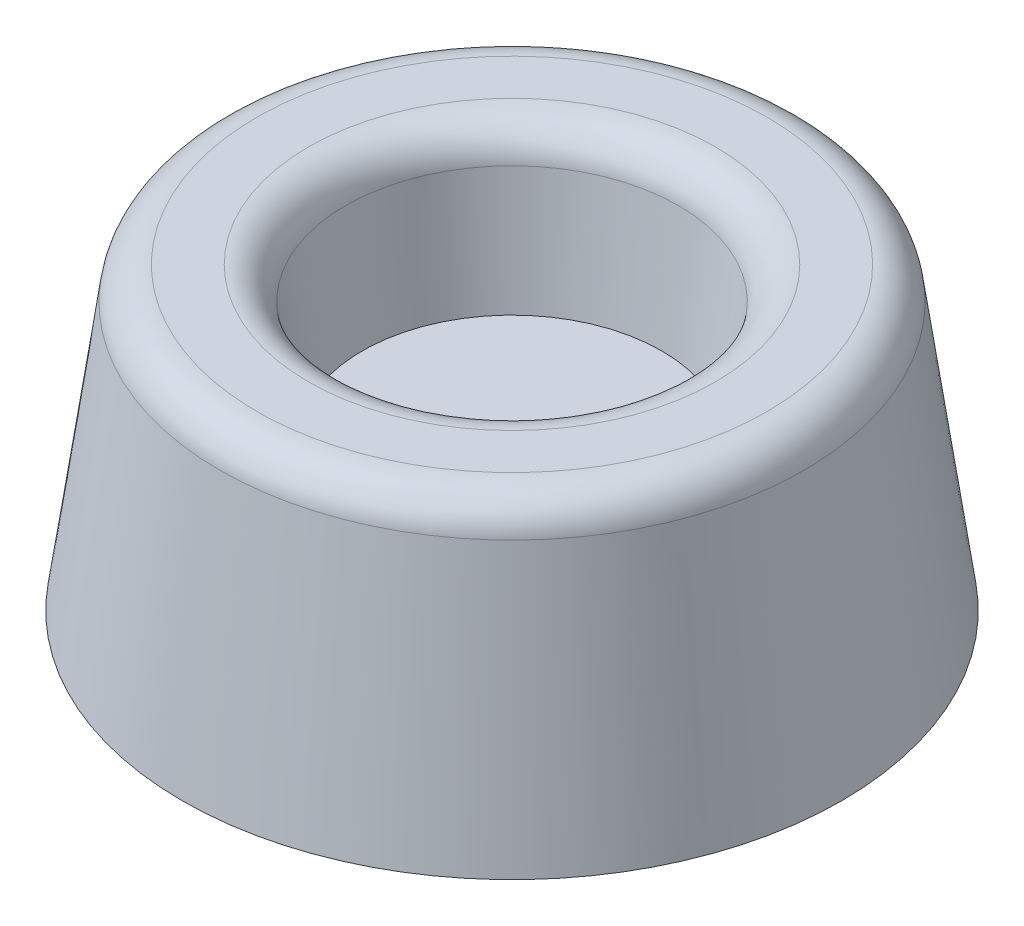
ISO-10303-21;
HEADER;
FILE_DESCRIPTION(('STEP AP214'),'2;1');
FILE_NAME('part.step','',(''),(''),'','','');
FILE_SCHEMA(('AUTOMOTIVE_DESIGN { 1 0 10303 214 1 1 1 1 }'));
ENDSEC;
DATA;
#1=APPLICATION_CONTEXT('core data for automotive mechanical design processes');
#2=APPLICATION_PROTOCOL_DEFINITION('international standard','automotive_design',2000,#1);
#3=PRODUCT_CONTEXT('',#1,'mechanical');
#4=PRODUCT('Part','Part','',(#3));
#5=PRODUCT_RELATED_PRODUCT_CATEGORY('part','',(#4));
#6=PRODUCT_DEFINITION_FORMATION('','',#4);
#7=PRODUCT_DEFINITION_CONTEXT('part definition',#1,'design');
#8=PRODUCT_DEFINITION('design','',#6,#7);
#9=PRODUCT_DEFINITION_SHAPE('','',#8);
#10=(LENGTH_UNIT() NAMED_UNIT(*) SI_UNIT(.MILLI.,.METRE.));
#11=(NAMED_UNIT(*) PLANE_ANGLE_UNIT() SI_UNIT($,.RADIAN.));
#12=(NAMED_UNIT(*) SI_UNIT($,.STERADIAN.) SOLID_ANGLE_UNIT());
#13=UNCERTAINTY_MEASURE_WITH_UNIT(LENGTH_MEASURE(1.E-05),#10,'distance_accuracy_value','');
#14=(GEOMETRIC_REPRESENTATION_CONTEXT(3) GLOBAL_UNCERTAINTY_ASSIGNED_CONTEXT((#13)) GLOBAL_UNIT_ASSIGNED_CONTEXT((#10,
#11,#12)) REPRESENTATION_CONTEXT('',''));
#15=CARTESIAN_POINT('',(0.,0.,0.));
#16=DIRECTION('',(0.,0.,1.));
#17=DIRECTION('',(1.,0.,0.));
#18=AXIS2_PLACEMENT_3D('',#15,#16,#17);
#19=CARTESIAN_POINT('',(0.,0.,0.));
#20=DIRECTION('',(0.,-1.,0.));
#21=DIRECTION('',(0.,0.,-1.));
#22=AXIS2_PLACEMENT_3D('',#19,#20,#21);
#23=PLANE('',#22);
#24=CARTESIAN_POINT('',(0.,0.,0.));
#25=DIRECTION('',(0.,-1.,0.));
#26=DIRECTION('',(0.,0.,-1.));
#27=AXIS2_PLACEMENT_3D('',#24,#25,#26);
#28=CIRCLE('',#27,11.176);
#29=CARTESIAN_POINT('',(0.,0.,-11.176));
#30=VERTEX_POINT('',#29);
#31=EDGE_CURVE('E10',#30,#30,#28,.T.);
#32=ORIENTED_EDGE('',*,*,#31,.T.);
#33=EDGE_LOOP('',(#32));
#34=FACE_BOUND('',#33,.T.);
#35=ADVANCED_FACE('F30',(#34),#23,.T.);
#36=CARTESIAN_POINT('',(0.,0.,0.));
#37=DIRECTION('',(0.,-1.,0.));
#38=DIRECTION('',(0.,0.,-1.));
#39=AXIS2_PLACEMENT_3D('',#36,#37,#38);
#40=CONICAL_SURFACE('',#39,11.176,0.139626340159547);
#41=CARTESIAN_POINT('',(0.,9.06674983821928,0.));
#42=DIRECTION('',(0.,-1.,0.));
#43=DIRECTION('',(0.,0.,-1.));
#44=AXIS2_PLACEMENT_3D('',#41,#42,#43);
#45=CIRCLE('',#44,9.90175140969888);
#46=CARTESIAN_POINT('',(0.,9.06674983821928,-9.90175140969888));
#47=VERTEX_POINT('',#46);
#48=EDGE_CURVE('E36',#47,#47,#45,.T.);
#49=ORIENTED_EDGE('',*,*,#48,.T.);
#50=EDGE_LOOP('',(#49));
#51=FACE_BOUND('',#50,.T.);
#52=ORIENTED_EDGE('',*,*,#31,.F.);
#53=EDGE_LOOP('',(#52));
#54=FACE_BOUND('',#53,.T.);
#55=ADVANCED_FACE('F68',(#51,#54),#40,.T.);
#56=CARTESIAN_POINT('',(0.,8.89,0.));
#57=DIRECTION('',(0.,-1.,0.));
#58=DIRECTION('',(0.,0.,-1.));
#59=AXIS2_PLACEMENT_3D('',#56,#57,#58);
#60=TOROIDAL_SURFACE('',#59,8.64411096239709,1.27);
#61=CARTESIAN_POINT('',(0.,10.16,0.));
#62=DIRECTION('',(0.,-1.,0.));
#63=DIRECTION('',(0.,0.,-1.));
#64=AXIS2_PLACEMENT_3D('',#61,#62,#63);
#65=CIRCLE('',#64,8.64411096239709);
#66=CARTESIAN_POINT('',(0.,10.16,-8.64411096239709));
#67=VERTEX_POINT('',#66);
#68=EDGE_CURVE('E40',#67,#67,#65,.T.);
#69=ORIENTED_EDGE('',*,*,#68,.T.);
#70=EDGE_LOOP('',(#69));
#71=FACE_BOUND('',#70,.T.);
#72=ORIENTED_EDGE('',*,*,#48,.F.);
#73=EDGE_LOOP('',(#72));
#74=FACE_BOUND('',#73,.T.);
#75=ADVANCED_FACE('F72',(#71,#74),#60,.T.);
#76=CARTESIAN_POINT('',(0.,10.16,-8.64411096239709));
#77=DIRECTION('',(0.,1.,0.));
#78=DIRECTION('',(0.,0.,1.));
#79=AXIS2_PLACEMENT_3D('',#76,#77,#78);
#80=PLANE('',#79);
#81=CARTESIAN_POINT('',(0.,10.16,0.));
#82=DIRECTION('',(0.,-1.,0.));
#83=DIRECTION('',(0.,0.,-1.));
#84=AXIS2_PLACEMENT_3D('',#81,#82,#83);
#85=CIRCLE('',#84,6.89794159731473);
#86=CARTESIAN_POINT('',(0.,10.16,-6.89794159731473));
#87=VERTEX_POINT('',#86);
#88=EDGE_CURVE('E44',#87,#87,#85,.T.);
#89=ORIENTED_EDGE('',*,*,#88,.T.);
#90=EDGE_LOOP('',(#89));
#91=FACE_BOUND('',#90,.T.);
#92=ORIENTED_EDGE('',*,*,#68,.F.);
#93=EDGE_LOOP('',(#92));
#94=FACE_BOUND('',#93,.T.);
#95=ADVANCED_FACE('F76',(#91,#94),#80,.T.);
#96=CARTESIAN_POINT('',(0.,8.89,0.));
#97=DIRECTION('',(0.,-1.,0.));
#98=DIRECTION('',(0.,0.,-1.));
#99=AXIS2_PLACEMENT_3D('',#96,#97,#98);
#100=TOROIDAL_SURFACE('',#99,6.89794159731473,1.27);
#101=CARTESIAN_POINT('',(0.,9.06674983821928,0.));
#102=DIRECTION('',(0.,-1.,0.));
#103=DIRECTION('',(0.,0.,-1.));
#104=AXIS2_PLACEMENT_3D('',#101,#102,#103);
#105=CIRCLE('',#104,5.64030115001293);
#106=CARTESIAN_POINT('',(0.,9.06674983821928,-5.64030115001293));
#107=VERTEX_POINT('',#106);
#108=EDGE_CURVE('E49',#107,#107,#105,.T.);
#109=ORIENTED_EDGE('',*,*,#108,.T.);
#110=EDGE_LOOP('',(#109));
#111=FACE_BOUND('',#110,.T.);
#112=ORIENTED_EDGE('',*,*,#88,.F.);
#113=EDGE_LOOP('',(#112));
#114=FACE_BOUND('',#113,.T.);
#115=ADVANCED_FACE('F65',(#111,#114),#100,.T.);
#116=CARTESIAN_POINT('',(0.,9.06674983821928,0.));
#117=DIRECTION('',(0.,1.,0.));
#118=DIRECTION('',(0.,0.,1.));
#119=AXIS2_PLACEMENT_3D('',#116,#117,#118);
#120=CONICAL_SURFACE('',#119,5.64030115001293,0.13962634015954);
#121=CARTESIAN_POINT('',(0.,5.08,0.));
#122=DIRECTION('',(0.,-1.,0.));
#123=DIRECTION('',(0.,0.,-1.));
#124=AXIS2_PLACEMENT_3D('',#121,#122,#123);
#125=CIRCLE('',#124,5.08);
#126=CARTESIAN_POINT('',(0.,5.08,-5.08));
#127=VERTEX_POINT('',#126);
#128=EDGE_CURVE('E52',#127,#127,#125,.T.);
#129=ORIENTED_EDGE('',*,*,#128,.T.);
#130=EDGE_LOOP('',(#129));
#131=FACE_BOUND('',#130,.T.);
#132=ORIENTED_EDGE('',*,*,#108,.F.);
#133=EDGE_LOOP('',(#132));
#134=FACE_BOUND('',#133,.T.);
#135=ADVANCED_FACE('F56',(#131,#134),#120,.F.);
#136=CARTESIAN_POINT('',(0.,5.08,-5.08));
#137=DIRECTION('',(0.,1.,0.));
#138=DIRECTION('',(0.,0.,1.));
#139=AXIS2_PLACEMENT_3D('',#136,#137,#138);
#140=PLANE('',#139);
#141=ORIENTED_EDGE('',*,*,#128,.F.);
#142=EDGE_LOOP('',(#141));
#143=FACE_BOUND('',#142,.T.);
#144=ADVANCED_FACE('F59',(#143),#140,.T.);
#145=CLOSED_SHELL('',(#35,#55,#75,#95,#115,#135,#144));
#146=MANIFOLD_SOLID_BREP('B2',#145);
#147=ADVANCED_BREP_SHAPE_REPRESENTATION('',(#18,#146),#14);
#148=SHAPE_DEFINITION_REPRESENTATION(#9,#147);
ENDSEC;
END-ISO-10303-21;
